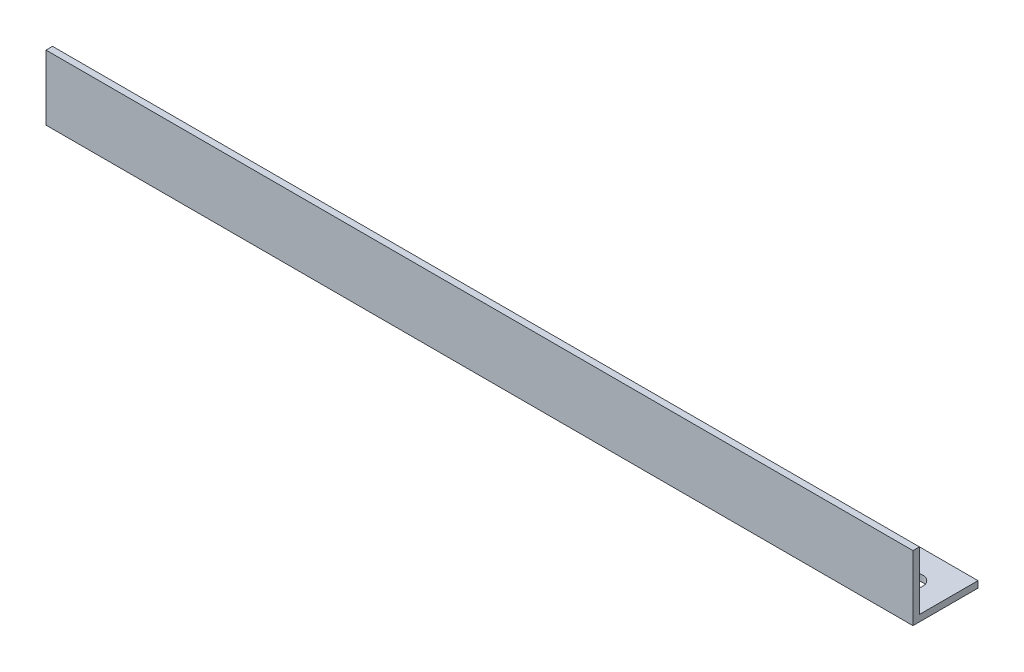
ISO-10303-21;
HEADER;
FILE_DESCRIPTION(('STEP AP214'),'2;1');
FILE_NAME('part.step','',(''),(''),'','','');
FILE_SCHEMA(('AUTOMOTIVE_DESIGN { 1 0 10303 214 1 1 1 1 }'));
ENDSEC;
DATA;
#1=APPLICATION_CONTEXT('core data for automotive mechanical design processes');
#2=APPLICATION_PROTOCOL_DEFINITION('international standard','automotive_design',2000,#1);
#3=PRODUCT_CONTEXT('',#1,'mechanical');
#4=PRODUCT('Part','Part','',(#3));
#5=PRODUCT_RELATED_PRODUCT_CATEGORY('part','',(#4));
#6=PRODUCT_DEFINITION_FORMATION('','',#4);
#7=PRODUCT_DEFINITION_CONTEXT('part definition',#1,'design');
#8=PRODUCT_DEFINITION('design','',#6,#7);
#9=PRODUCT_DEFINITION_SHAPE('','',#8);
#10=(LENGTH_UNIT() NAMED_UNIT(*) SI_UNIT(.MILLI.,.METRE.));
#11=(NAMED_UNIT(*) PLANE_ANGLE_UNIT() SI_UNIT($,.RADIAN.));
#12=(NAMED_UNIT(*) SI_UNIT($,.STERADIAN.) SOLID_ANGLE_UNIT());
#13=UNCERTAINTY_MEASURE_WITH_UNIT(LENGTH_MEASURE(1.E-05),#10,'distance_accuracy_value','');
#14=(GEOMETRIC_REPRESENTATION_CONTEXT(3) GLOBAL_UNCERTAINTY_ASSIGNED_CONTEXT((#13)) GLOBAL_UNIT_ASSIGNED_CONTEXT((#10,
#11,#12)) REPRESENTATION_CONTEXT('',''));
#15=CARTESIAN_POINT('',(0.,0.,0.));
#16=DIRECTION('',(0.,0.,1.));
#17=DIRECTION('',(1.,0.,0.));
#18=AXIS2_PLACEMENT_3D('',#15,#16,#17);
#19=CARTESIAN_POINT('',(200.,0.,-15.));
#20=DIRECTION('',(0.,1.,0.));
#21=DIRECTION('',(0.,0.,1.));
#22=AXIS2_PLACEMENT_3D('',#19,#20,#21);
#23=PLANE('',#22);
#24=CARTESIAN_POINT('',(7.5,0.,-7.49999999999999));
#25=DIRECTION('',(0.,-1.,0.));
#26=DIRECTION('',(0.,0.,-1.));
#27=AXIS2_PLACEMENT_3D('',#24,#25,#26);
#28=CIRCLE('',#27,2.25);
#29=CARTESIAN_POINT('',(7.5,0.,-9.74999999999999));
#30=VERTEX_POINT('',#29);
#31=EDGE_CURVE('E139',#30,#30,#28,.T.);
#32=ORIENTED_EDGE('',*,*,#31,.F.);
#33=EDGE_LOOP('',(#32));
#34=FACE_BOUND('',#33,.T.);
#35=CARTESIAN_POINT('',(192.5,0.,-7.49999999999999));
#36=DIRECTION('',(0.,-1.,0.));
#37=DIRECTION('',(0.,0.,-1.));
#38=AXIS2_PLACEMENT_3D('',#35,#36,#37);
#39=CIRCLE('',#38,2.25000000000001);
#40=CARTESIAN_POINT('',(192.5,0.,-9.75));
#41=VERTEX_POINT('',#40);
#42=EDGE_CURVE('E144',#41,#41,#39,.T.);
#43=ORIENTED_EDGE('',*,*,#42,.F.);
#44=EDGE_LOOP('',(#43));
#45=FACE_BOUND('',#44,.T.);
#46=DIRECTION('',(0.,0.,-1.));
#47=VECTOR('',#46,1.);
#48=CARTESIAN_POINT('',(0.,0.,-15.));
#49=LINE('',#48,#47);
#50=CARTESIAN_POINT('',(0.,0.,0.));
#51=VERTEX_POINT('',#50);
#52=CARTESIAN_POINT('',(0.,0.,-15.));
#53=VERTEX_POINT('',#52);
#54=EDGE_CURVE('E122',#51,#53,#49,.T.);
#55=ORIENTED_EDGE('',*,*,#54,.T.);
#56=DIRECTION('',(-1.,0.,0.));
#57=VECTOR('',#56,1.);
#58=CARTESIAN_POINT('',(200.,0.,-15.));
#59=LINE('',#58,#57);
#60=CARTESIAN_POINT('',(200.,0.,-15.));
#61=VERTEX_POINT('',#60);
#62=EDGE_CURVE('E11',#61,#53,#59,.T.);
#63=ORIENTED_EDGE('',*,*,#62,.F.);
#64=DIRECTION('',(0.,0.,-1.));
#65=VECTOR('',#64,1.);
#66=CARTESIAN_POINT('',(200.,0.,-15.));
#67=LINE('',#66,#65);
#68=CARTESIAN_POINT('',(200.,0.,0.));
#69=VERTEX_POINT('',#68);
#70=EDGE_CURVE('E132',#69,#61,#67,.T.);
#71=ORIENTED_EDGE('',*,*,#70,.F.);
#72=DIRECTION('',(-1.,0.,0.));
#73=VECTOR('',#72,1.);
#74=CARTESIAN_POINT('',(200.,0.,0.));
#75=LINE('',#74,#73);
#76=EDGE_CURVE('E118',#69,#51,#75,.T.);
#77=ORIENTED_EDGE('',*,*,#76,.T.);
#78=EDGE_LOOP('',(#55,#63,#71,#77));
#79=FACE_BOUND('',#78,.T.);
#80=ADVANCED_FACE('F36',(#34,#45,#79),#23,.F.);
#81=CARTESIAN_POINT('',(200.,1.49999999999998,-15.));
#82=DIRECTION('',(0.,0.,1.));
#83=DIRECTION('',(1.,0.,0.));
#84=AXIS2_PLACEMENT_3D('',#81,#82,#83);
#85=PLANE('',#84);
#86=DIRECTION('',(0.,1.,0.));
#87=VECTOR('',#86,1.);
#88=CARTESIAN_POINT('',(0.,1.49999999999998,-15.));
#89=LINE('',#88,#87);
#90=CARTESIAN_POINT('',(0.,1.49999999999998,-15.));
#91=VERTEX_POINT('',#90);
#92=EDGE_CURVE('E125',#53,#91,#89,.T.);
#93=ORIENTED_EDGE('',*,*,#92,.T.);
#94=DIRECTION('',(-1.,0.,0.));
#95=VECTOR('',#94,1.);
#96=CARTESIAN_POINT('',(200.,1.49999999999998,-15.));
#97=LINE('',#96,#95);
#98=CARTESIAN_POINT('',(200.,1.49999999999998,-15.));
#99=VERTEX_POINT('',#98);
#100=EDGE_CURVE('E45',#99,#91,#97,.T.);
#101=ORIENTED_EDGE('',*,*,#100,.F.);
#102=DIRECTION('',(0.,1.,0.));
#103=VECTOR('',#102,1.);
#104=CARTESIAN_POINT('',(200.,1.49999999999998,-15.));
#105=LINE('',#104,#103);
#106=EDGE_CURVE('E91',#61,#99,#105,.T.);
#107=ORIENTED_EDGE('',*,*,#106,.F.);
#108=ORIENTED_EDGE('',*,*,#62,.T.);
#109=EDGE_LOOP('',(#93,#101,#107,#108));
#110=FACE_BOUND('',#109,.T.);
#111=ADVANCED_FACE('F154',(#110),#85,.F.);
#112=CARTESIAN_POINT('',(200.,1.5,-1.50000000000002));
#113=DIRECTION('',(0.,-1.,0.));
#114=DIRECTION('',(0.,0.,-1.));
#115=AXIS2_PLACEMENT_3D('',#112,#113,#114);
#116=PLANE('',#115);
#117=CARTESIAN_POINT('',(7.5,1.49999999999999,-7.49999999999999));
#118=DIRECTION('',(0.,-1.,0.));
#119=DIRECTION('',(0.,0.,-1.));
#120=AXIS2_PLACEMENT_3D('',#117,#118,#119);
#121=CIRCLE('',#120,2.25);
#122=CARTESIAN_POINT('',(7.5,1.49999999999999,-9.74999999999999));
#123=VERTEX_POINT('',#122);
#124=EDGE_CURVE('E39',#123,#123,#121,.T.);
#125=ORIENTED_EDGE('',*,*,#124,.T.);
#126=EDGE_LOOP('',(#125));
#127=FACE_BOUND('',#126,.T.);
#128=CARTESIAN_POINT('',(192.5,1.49999999999999,-7.49999999999999));
#129=DIRECTION('',(0.,-1.,0.));
#130=DIRECTION('',(0.,0.,-1.));
#131=AXIS2_PLACEMENT_3D('',#128,#129,#130);
#132=CIRCLE('',#131,2.25000000000001);
#133=CARTESIAN_POINT('',(192.5,1.49999999999999,-9.75));
#134=VERTEX_POINT('',#133);
#135=EDGE_CURVE('E137',#134,#134,#132,.T.);
#136=ORIENTED_EDGE('',*,*,#135,.T.);
#137=EDGE_LOOP('',(#136));
#138=FACE_BOUND('',#137,.T.);
#139=DIRECTION('',(0.,0.,1.));
#140=VECTOR('',#139,1.);
#141=CARTESIAN_POINT('',(0.,1.5,-1.50000000000002));
#142=LINE('',#141,#140);
#143=CARTESIAN_POINT('',(0.,1.5,-1.50000000000002));
#144=VERTEX_POINT('',#143);
#145=EDGE_CURVE('E127',#91,#144,#142,.T.);
#146=ORIENTED_EDGE('',*,*,#145,.T.);
#147=DIRECTION('',(-1.,0.,0.));
#148=VECTOR('',#147,1.);
#149=CARTESIAN_POINT('',(200.,1.5,-1.50000000000002));
#150=LINE('',#149,#148);
#151=CARTESIAN_POINT('',(200.,1.5,-1.50000000000002));
#152=VERTEX_POINT('',#151);
#153=EDGE_CURVE('E113',#152,#144,#150,.T.);
#154=ORIENTED_EDGE('',*,*,#153,.F.);
#155=DIRECTION('',(0.,0.,1.));
#156=VECTOR('',#155,1.);
#157=CARTESIAN_POINT('',(200.,1.5,-1.50000000000002));
#158=LINE('',#157,#156);
#159=EDGE_CURVE('E104',#99,#152,#158,.T.);
#160=ORIENTED_EDGE('',*,*,#159,.F.);
#161=ORIENTED_EDGE('',*,*,#100,.T.);
#162=EDGE_LOOP('',(#146,#154,#160,#161));
#163=FACE_BOUND('',#162,.T.);
#164=ADVANCED_FACE('F157',(#127,#138,#163),#116,.F.);
#165=CARTESIAN_POINT('',(200.,15.,-1.5));
#166=DIRECTION('',(0.,0.,1.));
#167=DIRECTION('',(0.,-1.,0.));
#168=AXIS2_PLACEMENT_3D('',#165,#166,#167);
#169=PLANE('',#168);
#170=DIRECTION('',(0.,1.,0.));
#171=VECTOR('',#170,1.);
#172=CARTESIAN_POINT('',(0.,15.,-1.5));
#173=LINE('',#172,#171);
#174=CARTESIAN_POINT('',(0.,15.,-1.5));
#175=VERTEX_POINT('',#174);
#176=EDGE_CURVE('E112',#144,#175,#173,.T.);
#177=ORIENTED_EDGE('',*,*,#176,.T.);
#178=DIRECTION('',(-1.,0.,0.));
#179=VECTOR('',#178,1.);
#180=CARTESIAN_POINT('',(200.,15.,-1.5));
#181=LINE('',#180,#179);
#182=CARTESIAN_POINT('',(200.,15.,-1.5));
#183=VERTEX_POINT('',#182);
#184=EDGE_CURVE('E109',#183,#175,#181,.T.);
#185=ORIENTED_EDGE('',*,*,#184,.F.);
#186=DIRECTION('',(0.,1.,0.));
#187=VECTOR('',#186,1.);
#188=CARTESIAN_POINT('',(200.,15.,-1.5));
#189=LINE('',#188,#187);
#190=EDGE_CURVE('E98',#152,#183,#189,.T.);
#191=ORIENTED_EDGE('',*,*,#190,.F.);
#192=ORIENTED_EDGE('',*,*,#153,.T.);
#193=EDGE_LOOP('',(#177,#185,#191,#192));
#194=FACE_BOUND('',#193,.T.);
#195=ADVANCED_FACE('F110',(#194),#169,.F.);
#196=CARTESIAN_POINT('',(200.,15.,0.));
#197=DIRECTION('',(0.,-1.,0.));
#198=DIRECTION('',(0.,0.,-1.));
#199=AXIS2_PLACEMENT_3D('',#196,#197,#198);
#200=PLANE('',#199);
#201=DIRECTION('',(0.,0.,1.));
#202=VECTOR('',#201,1.);
#203=CARTESIAN_POINT('',(0.,15.,0.));
#204=LINE('',#203,#202);
#205=CARTESIAN_POINT('',(0.,15.,0.));
#206=VERTEX_POINT('',#205);
#207=EDGE_CURVE('E77',#175,#206,#204,.T.);
#208=ORIENTED_EDGE('',*,*,#207,.T.);
#209=DIRECTION('',(-1.,0.,0.));
#210=VECTOR('',#209,1.);
#211=CARTESIAN_POINT('',(200.,15.,0.));
#212=LINE('',#211,#210);
#213=CARTESIAN_POINT('',(200.,15.,0.));
#214=VERTEX_POINT('',#213);
#215=EDGE_CURVE('E114',#214,#206,#212,.T.);
#216=ORIENTED_EDGE('',*,*,#215,.F.);
#217=DIRECTION('',(0.,0.,1.));
#218=VECTOR('',#217,1.);
#219=CARTESIAN_POINT('',(200.,15.,0.));
#220=LINE('',#219,#218);
#221=EDGE_CURVE('E102',#183,#214,#220,.T.);
#222=ORIENTED_EDGE('',*,*,#221,.F.);
#223=ORIENTED_EDGE('',*,*,#184,.T.);
#224=EDGE_LOOP('',(#208,#216,#222,#223));
#225=FACE_BOUND('',#224,.T.);
#226=ADVANCED_FACE('F116',(#225),#200,.F.);
#227=CARTESIAN_POINT('',(200.,0.,0.));
#228=DIRECTION('',(0.,0.,-1.));
#229=DIRECTION('',(-1.,0.,0.));
#230=AXIS2_PLACEMENT_3D('',#227,#228,#229);
#231=PLANE('',#230);
#232=DIRECTION('',(0.,-1.,0.));
#233=VECTOR('',#232,1.);
#234=CARTESIAN_POINT('',(0.,0.,0.));
#235=LINE('',#234,#233);
#236=EDGE_CURVE('E83',#206,#51,#235,.T.);
#237=ORIENTED_EDGE('',*,*,#236,.T.);
#238=ORIENTED_EDGE('',*,*,#76,.F.);
#239=DIRECTION('',(0.,-1.,0.));
#240=VECTOR('',#239,1.);
#241=CARTESIAN_POINT('',(200.,0.,0.));
#242=LINE('',#241,#240);
#243=EDGE_CURVE('E54',#214,#69,#242,.T.);
#244=ORIENTED_EDGE('',*,*,#243,.F.);
#245=ORIENTED_EDGE('',*,*,#215,.T.);
#246=EDGE_LOOP('',(#237,#238,#244,#245));
#247=FACE_BOUND('',#246,.T.);
#248=ADVANCED_FACE('F162',(#247),#231,.F.);
#249=CARTESIAN_POINT('',(200.,0.,0.));
#250=DIRECTION('',(-1.,0.,0.));
#251=DIRECTION('',(0.,0.,1.));
#252=AXIS2_PLACEMENT_3D('',#249,#250,#251);
#253=PLANE('',#252);
#254=ORIENTED_EDGE('',*,*,#70,.T.);
#255=ORIENTED_EDGE('',*,*,#106,.T.);
#256=ORIENTED_EDGE('',*,*,#159,.T.);
#257=ORIENTED_EDGE('',*,*,#190,.T.);
#258=ORIENTED_EDGE('',*,*,#221,.T.);
#259=ORIENTED_EDGE('',*,*,#243,.T.);
#260=EDGE_LOOP('',(#254,#255,#256,#257,#258,#259));
#261=FACE_BOUND('',#260,.T.);
#262=ADVANCED_FACE('F100',(#261),#253,.F.);
#263=CARTESIAN_POINT('',(0.,0.,0.));
#264=DIRECTION('',(-1.,0.,0.));
#265=DIRECTION('',(0.,0.,1.));
#266=AXIS2_PLACEMENT_3D('',#263,#264,#265);
#267=PLANE('',#266);
#268=ORIENTED_EDGE('',*,*,#54,.F.);
#269=ORIENTED_EDGE('',*,*,#236,.F.);
#270=ORIENTED_EDGE('',*,*,#207,.F.);
#271=ORIENTED_EDGE('',*,*,#176,.F.);
#272=ORIENTED_EDGE('',*,*,#145,.F.);
#273=ORIENTED_EDGE('',*,*,#92,.F.);
#274=EDGE_LOOP('',(#268,#269,#270,#271,#272,#273));
#275=FACE_BOUND('',#274,.T.);
#276=ADVANCED_FACE('F160',(#275),#267,.T.);
#277=CARTESIAN_POINT('',(192.5,15.,-7.50000000000001));
#278=DIRECTION('',(0.,-1.,0.));
#279=DIRECTION('',(0.,0.,-1.));
#280=AXIS2_PLACEMENT_3D('',#277,#278,#279);
#281=CYLINDRICAL_SURFACE('',#280,2.25000000000001);
#282=ORIENTED_EDGE('',*,*,#42,.T.);
#283=EDGE_LOOP('',(#282));
#284=FACE_BOUND('',#283,.T.);
#285=ORIENTED_EDGE('',*,*,#135,.F.);
#286=EDGE_LOOP('',(#285));
#287=FACE_BOUND('',#286,.T.);
#288=ADVANCED_FACE('F180',(#284,#287),#281,.F.);
#289=CARTESIAN_POINT('',(7.5,15.,-7.50000000000001));
#290=DIRECTION('',(0.,-1.,0.));
#291=DIRECTION('',(0.,0.,-1.));
#292=AXIS2_PLACEMENT_3D('',#289,#290,#291);
#293=CYLINDRICAL_SURFACE('',#292,2.25);
#294=ORIENTED_EDGE('',*,*,#31,.T.);
#295=EDGE_LOOP('',(#294));
#296=FACE_BOUND('',#295,.T.);
#297=ORIENTED_EDGE('',*,*,#124,.F.);
#298=EDGE_LOOP('',(#297));
#299=FACE_BOUND('',#298,.T.);
#300=ADVANCED_FACE('F183',(#296,#299),#293,.F.);
#301=CLOSED_SHELL('',(#80,#111,#164,#195,#226,#248,#262,#276,#288,#300));
#302=MANIFOLD_SOLID_BREP('B2',#301);
#303=ADVANCED_BREP_SHAPE_REPRESENTATION('',(#18,#302),#14);
#304=SHAPE_DEFINITION_REPRESENTATION(#9,#303);
ENDSEC;
END-ISO-10303-21;
